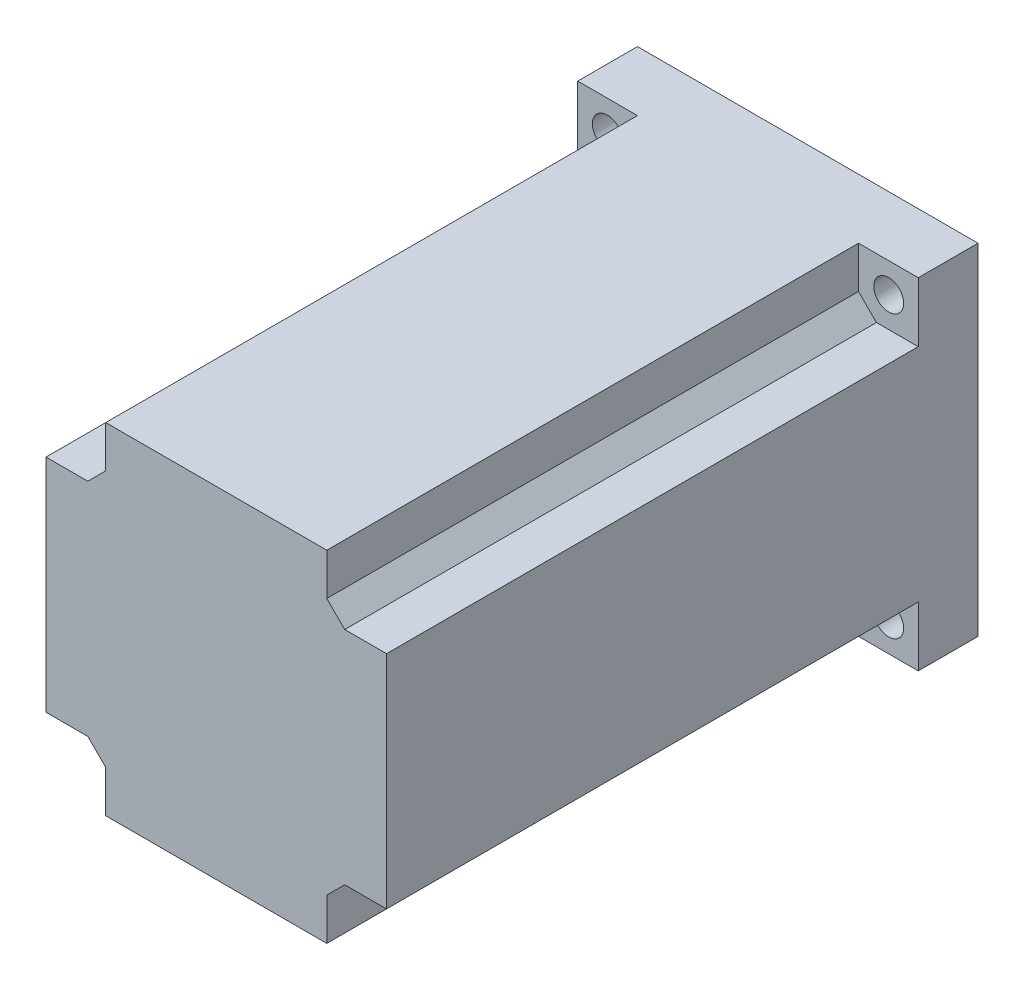
ISO-10303-21;
HEADER;
FILE_DESCRIPTION(('STEP AP214'),'2;1');
FILE_NAME('part.step','',(''),(''),'','','');
FILE_SCHEMA(('AUTOMOTIVE_DESIGN { 1 0 10303 214 1 1 1 1 }'));
ENDSEC;
DATA;
#1=APPLICATION_CONTEXT('core data for automotive mechanical design processes');
#2=APPLICATION_PROTOCOL_DEFINITION('international standard','automotive_design',2000,#1);
#3=PRODUCT_CONTEXT('',#1,'mechanical');
#4=PRODUCT('Part','Part','',(#3));
#5=PRODUCT_RELATED_PRODUCT_CATEGORY('part','',(#4));
#6=PRODUCT_DEFINITION_FORMATION('','',#4);
#7=PRODUCT_DEFINITION_CONTEXT('part definition',#1,'design');
#8=PRODUCT_DEFINITION('design','',#6,#7);
#9=PRODUCT_DEFINITION_SHAPE('','',#8);
#10=(LENGTH_UNIT() NAMED_UNIT(*) SI_UNIT(.MILLI.,.METRE.));
#11=(NAMED_UNIT(*) PLANE_ANGLE_UNIT() SI_UNIT($,.RADIAN.));
#12=(NAMED_UNIT(*) SI_UNIT($,.STERADIAN.) SOLID_ANGLE_UNIT());
#13=UNCERTAINTY_MEASURE_WITH_UNIT(LENGTH_MEASURE(1.E-05),#10,'distance_accuracy_value','');
#14=(GEOMETRIC_REPRESENTATION_CONTEXT(3) GLOBAL_UNCERTAINTY_ASSIGNED_CONTEXT((#13)) GLOBAL_UNIT_ASSIGNED_CONTEXT((#10,
#11,#12)) REPRESENTATION_CONTEXT('',''));
#15=CARTESIAN_POINT('',(0.,0.,0.));
#16=DIRECTION('',(0.,0.,1.));
#17=DIRECTION('',(1.,0.,0.));
#18=AXIS2_PLACEMENT_3D('',#15,#16,#17);
#19=CARTESIAN_POINT('',(0.,0.,99.));
#20=DIRECTION('',(0.,0.,1.));
#21=DIRECTION('',(1.,0.,0.));
#22=AXIS2_PLACEMENT_3D('',#19,#20,#21);
#23=PLANE('',#22);
#24=DIRECTION('',(0.,-1.,0.));
#25=VECTOR('',#24,1.);
#26=CARTESIAN_POINT('',(-28.5,28.5,99.));
#27=LINE('',#26,#25);
#28=CARTESIAN_POINT('',(-28.5,18.5,99.));
#29=VERTEX_POINT('',#28);
#30=CARTESIAN_POINT('',(-28.5,-18.5,99.));
#31=VERTEX_POINT('',#30);
#32=EDGE_CURVE('E208',#29,#31,#27,.T.);
#33=ORIENTED_EDGE('',*,*,#32,.T.);
#34=DIRECTION('',(1.,0.,0.));
#35=VECTOR('',#34,1.);
#36=CARTESIAN_POINT('',(-28.5,-18.5,99.));
#37=LINE('',#36,#35);
#38=CARTESIAN_POINT('',(-21.5,-18.5,99.));
#39=VERTEX_POINT('',#38);
#40=EDGE_CURVE('E329',#31,#39,#37,.T.);
#41=ORIENTED_EDGE('',*,*,#40,.T.);
#42=DIRECTION('',(0.707106781186551,-0.707106781186544,0.));
#43=VECTOR('',#42,1.);
#44=CARTESIAN_POINT('',(-21.5,-18.5,99.));
#45=LINE('',#44,#43);
#46=CARTESIAN_POINT('',(-18.5,-21.5,99.));
#47=VERTEX_POINT('',#46);
#48=EDGE_CURVE('E47',#39,#47,#45,.T.);
#49=ORIENTED_EDGE('',*,*,#48,.T.);
#50=DIRECTION('',(0.,1.,0.));
#51=VECTOR('',#50,1.);
#52=CARTESIAN_POINT('',(-18.5,-28.5,99.));
#53=LINE('',#52,#51);
#54=CARTESIAN_POINT('',(-18.5,-28.5,99.));
#55=VERTEX_POINT('',#54);
#56=EDGE_CURVE('E327',#55,#47,#53,.T.);
#57=ORIENTED_EDGE('',*,*,#56,.F.);
#58=DIRECTION('',(1.,0.,0.));
#59=VECTOR('',#58,1.);
#60=CARTESIAN_POINT('',(-28.5,-28.5,99.));
#61=LINE('',#60,#59);
#62=CARTESIAN_POINT('',(18.5,-28.5,99.));
#63=VERTEX_POINT('',#62);
#64=EDGE_CURVE('E211',#55,#63,#61,.T.);
#65=ORIENTED_EDGE('',*,*,#64,.T.);
#66=DIRECTION('',(0.,1.,0.));
#67=VECTOR('',#66,1.);
#68=CARTESIAN_POINT('',(18.5,-28.5,99.));
#69=LINE('',#68,#67);
#70=CARTESIAN_POINT('',(18.5,-21.5,99.));
#71=VERTEX_POINT('',#70);
#72=EDGE_CURVE('E289',#63,#71,#69,.T.);
#73=ORIENTED_EDGE('',*,*,#72,.T.);
#74=DIRECTION('',(0.707106781186543,0.707106781186552,0.));
#75=VECTOR('',#74,1.);
#76=CARTESIAN_POINT('',(18.5,-21.5,99.));
#77=LINE('',#76,#75);
#78=CARTESIAN_POINT('',(21.5,-18.5,99.));
#79=VERTEX_POINT('',#78);
#80=EDGE_CURVE('E283',#71,#79,#77,.T.);
#81=ORIENTED_EDGE('',*,*,#80,.T.);
#82=DIRECTION('',(-1.,0.,0.));
#83=VECTOR('',#82,1.);
#84=CARTESIAN_POINT('',(28.5,-18.5,99.));
#85=LINE('',#84,#83);
#86=CARTESIAN_POINT('',(28.5,-18.5,99.));
#87=VERTEX_POINT('',#86);
#88=EDGE_CURVE('E287',#87,#79,#85,.T.);
#89=ORIENTED_EDGE('',*,*,#88,.F.);
#90=DIRECTION('',(0.,1.,0.));
#91=VECTOR('',#90,1.);
#92=CARTESIAN_POINT('',(28.5,28.5,99.));
#93=LINE('',#92,#91);
#94=CARTESIAN_POINT('',(28.5,18.5,99.));
#95=VERTEX_POINT('',#94);
#96=EDGE_CURVE('E209',#87,#95,#93,.T.);
#97=ORIENTED_EDGE('',*,*,#96,.T.);
#98=DIRECTION('',(-1.,0.,0.));
#99=VECTOR('',#98,1.);
#100=CARTESIAN_POINT('',(28.5,18.5,99.));
#101=LINE('',#100,#99);
#102=CARTESIAN_POINT('',(21.5,18.5,99.));
#103=VERTEX_POINT('',#102);
#104=EDGE_CURVE('E201',#95,#103,#101,.T.);
#105=ORIENTED_EDGE('',*,*,#104,.T.);
#106=DIRECTION('',(-0.707106781186552,0.707106781186543,0.));
#107=VECTOR('',#106,1.);
#108=CARTESIAN_POINT('',(21.5,18.5,99.));
#109=LINE('',#108,#107);
#110=CARTESIAN_POINT('',(18.5,21.5,99.));
#111=VERTEX_POINT('',#110);
#112=EDGE_CURVE('E200',#103,#111,#109,.T.);
#113=ORIENTED_EDGE('',*,*,#112,.T.);
#114=DIRECTION('',(0.,-1.,0.));
#115=VECTOR('',#114,1.);
#116=CARTESIAN_POINT('',(18.5,28.5,99.));
#117=LINE('',#116,#115);
#118=CARTESIAN_POINT('',(18.5,28.5,99.));
#119=VERTEX_POINT('',#118);
#120=EDGE_CURVE('E184',#119,#111,#117,.T.);
#121=ORIENTED_EDGE('',*,*,#120,.F.);
#122=DIRECTION('',(-1.,0.,0.));
#123=VECTOR('',#122,1.);
#124=CARTESIAN_POINT('',(-28.5,28.5,99.));
#125=LINE('',#124,#123);
#126=CARTESIAN_POINT('',(-18.5,28.5,99.));
#127=VERTEX_POINT('',#126);
#128=EDGE_CURVE('E198',#119,#127,#125,.T.);
#129=ORIENTED_EDGE('',*,*,#128,.T.);
#130=DIRECTION('',(0.,-1.,0.));
#131=VECTOR('',#130,1.);
#132=CARTESIAN_POINT('',(-18.5,28.5,99.));
#133=LINE('',#132,#131);
#134=CARTESIAN_POINT('',(-18.5,21.5,99.));
#135=VERTEX_POINT('',#134);
#136=EDGE_CURVE('E345',#127,#135,#133,.T.);
#137=ORIENTED_EDGE('',*,*,#136,.T.);
#138=DIRECTION('',(-0.707106781186544,-0.707106781186551,0.));
#139=VECTOR('',#138,1.);
#140=CARTESIAN_POINT('',(-18.5,21.5,99.));
#141=LINE('',#140,#139);
#142=CARTESIAN_POINT('',(-21.5,18.5,99.));
#143=VERTEX_POINT('',#142);
#144=EDGE_CURVE('E281',#135,#143,#141,.T.);
#145=ORIENTED_EDGE('',*,*,#144,.T.);
#146=DIRECTION('',(1.,0.,0.));
#147=VECTOR('',#146,1.);
#148=CARTESIAN_POINT('',(-28.5,18.5,99.));
#149=LINE('',#148,#147);
#150=EDGE_CURVE('E353',#29,#143,#149,.T.);
#151=ORIENTED_EDGE('',*,*,#150,.F.);
#152=EDGE_LOOP('',(#33,#41,#49,#57,#65,#73,#81,#89,#97,#105,#113,#121,#129,#137,#145,#151));
#153=FACE_BOUND('',#152,.T.);
#154=ADVANCED_FACE('F43',(#153),#23,.T.);
#155=CARTESIAN_POINT('',(28.5,28.5,99.));
#156=DIRECTION('',(-1.,0.,0.));
#157=DIRECTION('',(0.,-1.,0.));
#158=AXIS2_PLACEMENT_3D('',#155,#156,#157);
#159=PLANE('',#158);
#160=ORIENTED_EDGE('',*,*,#96,.F.);
#161=DIRECTION('',(0.,0.,1.));
#162=VECTOR('',#161,1.);
#163=CARTESIAN_POINT('',(28.5,-18.5,10.));
#164=LINE('',#163,#162);
#165=CARTESIAN_POINT('',(28.5,-18.5,10.));
#166=VERTEX_POINT('',#165);
#167=EDGE_CURVE('E297',#166,#87,#164,.T.);
#168=ORIENTED_EDGE('',*,*,#167,.F.);
#169=DIRECTION('',(0.,1.,0.));
#170=VECTOR('',#169,1.);
#171=CARTESIAN_POINT('',(28.5,-28.5,10.));
#172=LINE('',#171,#170);
#173=CARTESIAN_POINT('',(28.5,-28.5,10.));
#174=VERTEX_POINT('',#173);
#175=EDGE_CURVE('E316',#174,#166,#172,.T.);
#176=ORIENTED_EDGE('',*,*,#175,.F.);
#177=DIRECTION('',(0.,0.,-1.));
#178=VECTOR('',#177,1.);
#179=CARTESIAN_POINT('',(28.5,-28.5,99.));
#180=LINE('',#179,#178);
#181=CARTESIAN_POINT('',(28.5,-28.5,0.));
#182=VERTEX_POINT('',#181);
#183=EDGE_CURVE('E220',#174,#182,#180,.T.);
#184=ORIENTED_EDGE('',*,*,#183,.T.);
#185=DIRECTION('',(0.,1.,0.));
#186=VECTOR('',#185,1.);
#187=CARTESIAN_POINT('',(28.5,28.5,0.));
#188=LINE('',#187,#186);
#189=CARTESIAN_POINT('',(28.5,28.5,0.));
#190=VERTEX_POINT('',#189);
#191=EDGE_CURVE('E221',#182,#190,#188,.T.);
#192=ORIENTED_EDGE('',*,*,#191,.T.);
#193=DIRECTION('',(0.,0.,-1.));
#194=VECTOR('',#193,1.);
#195=CARTESIAN_POINT('',(28.5,28.5,99.));
#196=LINE('',#195,#194);
#197=CARTESIAN_POINT('',(28.5,28.5,10.));
#198=VERTEX_POINT('',#197);
#199=EDGE_CURVE('E238',#198,#190,#196,.T.);
#200=ORIENTED_EDGE('',*,*,#199,.F.);
#201=DIRECTION('',(0.,-1.,0.));
#202=VECTOR('',#201,1.);
#203=CARTESIAN_POINT('',(28.5,28.5,10.));
#204=LINE('',#203,#202);
#205=CARTESIAN_POINT('',(28.5,18.5,10.));
#206=VERTEX_POINT('',#205);
#207=EDGE_CURVE('E202',#198,#206,#204,.T.);
#208=ORIENTED_EDGE('',*,*,#207,.T.);
#209=DIRECTION('',(0.,0.,1.));
#210=VECTOR('',#209,1.);
#211=CARTESIAN_POINT('',(28.5,18.5,10.));
#212=LINE('',#211,#210);
#213=EDGE_CURVE('E193',#206,#95,#212,.T.);
#214=ORIENTED_EDGE('',*,*,#213,.T.);
#215=EDGE_LOOP('',(#160,#168,#176,#184,#192,#200,#208,#214));
#216=FACE_BOUND('',#215,.T.);
#217=ADVANCED_FACE('F390',(#216),#159,.F.);
#218=CARTESIAN_POINT('',(-28.5,28.5,99.));
#219=DIRECTION('',(0.,-1.,0.));
#220=DIRECTION('',(0.,0.,-1.));
#221=AXIS2_PLACEMENT_3D('',#218,#219,#220);
#222=PLANE('',#221);
#223=ORIENTED_EDGE('',*,*,#128,.F.);
#224=DIRECTION('',(0.,0.,1.));
#225=VECTOR('',#224,1.);
#226=CARTESIAN_POINT('',(18.5,28.5,10.));
#227=LINE('',#226,#225);
#228=CARTESIAN_POINT('',(18.5,28.5,10.));
#229=VERTEX_POINT('',#228);
#230=EDGE_CURVE('E181',#229,#119,#227,.T.);
#231=ORIENTED_EDGE('',*,*,#230,.F.);
#232=DIRECTION('',(-1.,0.,0.));
#233=VECTOR('',#232,1.);
#234=CARTESIAN_POINT('',(28.5,28.5,10.));
#235=LINE('',#234,#233);
#236=EDGE_CURVE('E192',#198,#229,#235,.T.);
#237=ORIENTED_EDGE('',*,*,#236,.F.);
#238=ORIENTED_EDGE('',*,*,#199,.T.);
#239=DIRECTION('',(-1.,0.,0.));
#240=VECTOR('',#239,1.);
#241=CARTESIAN_POINT('',(-28.5,28.5,0.));
#242=LINE('',#241,#240);
#243=CARTESIAN_POINT('',(-28.5,28.5,0.));
#244=VERTEX_POINT('',#243);
#245=EDGE_CURVE('E224',#190,#244,#242,.T.);
#246=ORIENTED_EDGE('',*,*,#245,.T.);
#247=DIRECTION('',(0.,0.,-1.));
#248=VECTOR('',#247,1.);
#249=CARTESIAN_POINT('',(-28.5,28.5,99.));
#250=LINE('',#249,#248);
#251=CARTESIAN_POINT('',(-28.5,28.5,10.));
#252=VERTEX_POINT('',#251);
#253=EDGE_CURVE('E236',#252,#244,#250,.T.);
#254=ORIENTED_EDGE('',*,*,#253,.F.);
#255=DIRECTION('',(1.,0.,0.));
#256=VECTOR('',#255,1.);
#257=CARTESIAN_POINT('',(-28.5,28.5,10.));
#258=LINE('',#257,#256);
#259=CARTESIAN_POINT('',(-18.5,28.5,10.));
#260=VERTEX_POINT('',#259);
#261=EDGE_CURVE('E348',#252,#260,#258,.T.);
#262=ORIENTED_EDGE('',*,*,#261,.T.);
#263=DIRECTION('',(0.,0.,1.));
#264=VECTOR('',#263,1.);
#265=CARTESIAN_POINT('',(-18.5,28.5,10.));
#266=LINE('',#265,#264);
#267=EDGE_CURVE('E207',#260,#127,#266,.T.);
#268=ORIENTED_EDGE('',*,*,#267,.T.);
#269=EDGE_LOOP('',(#223,#231,#237,#238,#246,#254,#262,#268));
#270=FACE_BOUND('',#269,.T.);
#271=ADVANCED_FACE('F205',(#270),#222,.F.);
#272=CARTESIAN_POINT('',(-28.5,28.5,99.));
#273=DIRECTION('',(1.,0.,0.));
#274=DIRECTION('',(0.,1.,0.));
#275=AXIS2_PLACEMENT_3D('',#272,#273,#274);
#276=PLANE('',#275);
#277=DIRECTION('',(0.,0.,1.));
#278=VECTOR('',#277,1.);
#279=CARTESIAN_POINT('',(-28.5,-18.5,10.));
#280=LINE('',#279,#278);
#281=CARTESIAN_POINT('',(-28.5,-18.5,10.));
#282=VERTEX_POINT('',#281);
#283=EDGE_CURVE('E320',#282,#31,#280,.T.);
#284=ORIENTED_EDGE('',*,*,#283,.T.);
#285=ORIENTED_EDGE('',*,*,#32,.F.);
#286=DIRECTION('',(0.,0.,1.));
#287=VECTOR('',#286,1.);
#288=CARTESIAN_POINT('',(-28.5,18.5,10.));
#289=LINE('',#288,#287);
#290=CARTESIAN_POINT('',(-28.5,18.5,10.));
#291=VERTEX_POINT('',#290);
#292=EDGE_CURVE('E245',#291,#29,#289,.T.);
#293=ORIENTED_EDGE('',*,*,#292,.F.);
#294=DIRECTION('',(0.,-1.,0.));
#295=VECTOR('',#294,1.);
#296=CARTESIAN_POINT('',(-28.5,28.5,10.));
#297=LINE('',#296,#295);
#298=EDGE_CURVE('E350',#252,#291,#297,.T.);
#299=ORIENTED_EDGE('',*,*,#298,.F.);
#300=ORIENTED_EDGE('',*,*,#253,.T.);
#301=DIRECTION('',(0.,-1.,0.));
#302=VECTOR('',#301,1.);
#303=CARTESIAN_POINT('',(-28.5,28.5,0.));
#304=LINE('',#303,#302);
#305=CARTESIAN_POINT('',(-28.5,-28.5,0.));
#306=VERTEX_POINT('',#305);
#307=EDGE_CURVE('E228',#244,#306,#304,.T.);
#308=ORIENTED_EDGE('',*,*,#307,.T.);
#309=DIRECTION('',(0.,0.,-1.));
#310=VECTOR('',#309,1.);
#311=CARTESIAN_POINT('',(-28.5,-28.5,99.));
#312=LINE('',#311,#310);
#313=CARTESIAN_POINT('',(-28.5,-28.5,10.));
#314=VERTEX_POINT('',#313);
#315=EDGE_CURVE('E234',#314,#306,#312,.T.);
#316=ORIENTED_EDGE('',*,*,#315,.F.);
#317=DIRECTION('',(0.,1.,0.));
#318=VECTOR('',#317,1.);
#319=CARTESIAN_POINT('',(-28.5,-28.5,10.));
#320=LINE('',#319,#318);
#321=EDGE_CURVE('E330',#314,#282,#320,.T.);
#322=ORIENTED_EDGE('',*,*,#321,.T.);
#323=EDGE_LOOP('',(#284,#285,#293,#299,#300,#308,#316,#322));
#324=FACE_BOUND('',#323,.T.);
#325=ADVANCED_FACE('F399',(#324),#276,.F.);
#326=CARTESIAN_POINT('',(-28.5,-28.5,99.));
#327=DIRECTION('',(0.,1.,0.));
#328=DIRECTION('',(0.,0.,1.));
#329=AXIS2_PLACEMENT_3D('',#326,#327,#328);
#330=PLANE('',#329);
#331=ORIENTED_EDGE('',*,*,#64,.F.);
#332=DIRECTION('',(0.,0.,1.));
#333=VECTOR('',#332,1.);
#334=CARTESIAN_POINT('',(-18.5,-28.5,10.));
#335=LINE('',#334,#333);
#336=CARTESIAN_POINT('',(-18.5,-28.5,10.));
#337=VERTEX_POINT('',#336);
#338=EDGE_CURVE('E323',#337,#55,#335,.T.);
#339=ORIENTED_EDGE('',*,*,#338,.F.);
#340=DIRECTION('',(1.,0.,0.));
#341=VECTOR('',#340,1.);
#342=CARTESIAN_POINT('',(-28.5,-28.5,10.));
#343=LINE('',#342,#341);
#344=EDGE_CURVE('E326',#314,#337,#343,.T.);
#345=ORIENTED_EDGE('',*,*,#344,.F.);
#346=ORIENTED_EDGE('',*,*,#315,.T.);
#347=DIRECTION('',(1.,0.,0.));
#348=VECTOR('',#347,1.);
#349=CARTESIAN_POINT('',(-28.5,-28.5,0.));
#350=LINE('',#349,#348);
#351=EDGE_CURVE('E214',#306,#182,#350,.T.);
#352=ORIENTED_EDGE('',*,*,#351,.T.);
#353=ORIENTED_EDGE('',*,*,#183,.F.);
#354=DIRECTION('',(-1.,0.,0.));
#355=VECTOR('',#354,1.);
#356=CARTESIAN_POINT('',(28.5,-28.5,10.));
#357=LINE('',#356,#355);
#358=CARTESIAN_POINT('',(18.5,-28.5,10.));
#359=VERTEX_POINT('',#358);
#360=EDGE_CURVE('E298',#174,#359,#357,.T.);
#361=ORIENTED_EDGE('',*,*,#360,.T.);
#362=DIRECTION('',(0.,0.,1.));
#363=VECTOR('',#362,1.);
#364=CARTESIAN_POINT('',(18.5,-28.5,10.));
#365=LINE('',#364,#363);
#366=EDGE_CURVE('E313',#359,#63,#365,.T.);
#367=ORIENTED_EDGE('',*,*,#366,.T.);
#368=EDGE_LOOP('',(#331,#339,#345,#346,#352,#353,#361,#367));
#369=FACE_BOUND('',#368,.T.);
#370=ADVANCED_FACE('F384',(#369),#330,.F.);
#371=CARTESIAN_POINT('',(0.,0.,0.));
#372=DIRECTION('',(0.,0.,1.));
#373=DIRECTION('',(1.,0.,0.));
#374=AXIS2_PLACEMENT_3D('',#371,#372,#373);
#375=PLANE('',#374);
#376=CARTESIAN_POINT('',(0.,0.,0.));
#377=DIRECTION('',(0.,0.,-1.));
#378=DIRECTION('',(-1.,0.,0.));
#379=AXIS2_PLACEMENT_3D('',#376,#377,#378);
#380=CIRCLE('',#379,19.05);
#381=CARTESIAN_POINT('',(-19.05,0.,0.));
#382=VERTEX_POINT('',#381);
#383=EDGE_CURVE('E11',#382,#382,#380,.T.);
#384=ORIENTED_EDGE('',*,*,#383,.F.);
#385=EDGE_LOOP('',(#384));
#386=FACE_BOUND('',#385,.T.);
#387=ORIENTED_EDGE('',*,*,#191,.F.);
#388=ORIENTED_EDGE('',*,*,#351,.F.);
#389=ORIENTED_EDGE('',*,*,#307,.F.);
#390=ORIENTED_EDGE('',*,*,#245,.F.);
#391=EDGE_LOOP('',(#387,#388,#389,#390));
#392=FACE_BOUND('',#391,.T.);
#393=CARTESIAN_POINT('',(23.55,-23.55,0.));
#394=DIRECTION('',(0.,0.,1.));
#395=DIRECTION('',(1.,0.,0.));
#396=AXIS2_PLACEMENT_3D('',#393,#394,#395);
#397=CIRCLE('',#396,2.5);
#398=CARTESIAN_POINT('',(26.05,-23.55,0.));
#399=VERTEX_POINT('',#398);
#400=EDGE_CURVE('E225',#399,#399,#397,.T.);
#401=ORIENTED_EDGE('',*,*,#400,.T.);
#402=EDGE_LOOP('',(#401));
#403=FACE_BOUND('',#402,.T.);
#404=CARTESIAN_POINT('',(23.55,23.55,0.));
#405=DIRECTION('',(0.,0.,1.));
#406=DIRECTION('',(-1.,0.,0.));
#407=AXIS2_PLACEMENT_3D('',#404,#405,#406);
#408=CIRCLE('',#407,2.5);
#409=CARTESIAN_POINT('',(21.05,23.55,0.));
#410=VERTEX_POINT('',#409);
#411=EDGE_CURVE('E364',#410,#410,#408,.T.);
#412=ORIENTED_EDGE('',*,*,#411,.T.);
#413=EDGE_LOOP('',(#412));
#414=FACE_BOUND('',#413,.T.);
#415=CARTESIAN_POINT('',(-23.55,23.55,0.));
#416=DIRECTION('',(0.,0.,1.));
#417=DIRECTION('',(1.,0.,0.));
#418=AXIS2_PLACEMENT_3D('',#415,#416,#417);
#419=CIRCLE('',#418,2.5);
#420=CARTESIAN_POINT('',(-21.05,23.55,0.));
#421=VERTEX_POINT('',#420);
#422=EDGE_CURVE('E361',#421,#421,#419,.T.);
#423=ORIENTED_EDGE('',*,*,#422,.T.);
#424=EDGE_LOOP('',(#423));
#425=FACE_BOUND('',#424,.T.);
#426=CARTESIAN_POINT('',(-23.55,-23.55,0.));
#427=DIRECTION('',(0.,0.,1.));
#428=DIRECTION('',(-1.,0.,0.));
#429=AXIS2_PLACEMENT_3D('',#426,#427,#428);
#430=CIRCLE('',#429,2.5);
#431=CARTESIAN_POINT('',(-26.05,-23.55,0.));
#432=VERTEX_POINT('',#431);
#433=EDGE_CURVE('E254',#432,#432,#430,.T.);
#434=ORIENTED_EDGE('',*,*,#433,.T.);
#435=EDGE_LOOP('',(#434));
#436=FACE_BOUND('',#435,.T.);
#437=ADVANCED_FACE('F369',(#386,#392,#403,#414,#425,#436),#375,.F.);
#438=CARTESIAN_POINT('',(23.55,-23.55,99.));
#439=DIRECTION('',(0.,0.,-1.));
#440=DIRECTION('',(-1.,0.,0.));
#441=AXIS2_PLACEMENT_3D('',#438,#439,#440);
#442=CYLINDRICAL_SURFACE('',#441,2.5);
#443=CARTESIAN_POINT('',(23.55,-23.55,10.));
#444=DIRECTION('',(0.,0.,-1.));
#445=DIRECTION('',(-1.,0.,0.));
#446=AXIS2_PLACEMENT_3D('',#443,#444,#445);
#447=CIRCLE('',#446,2.5);
#448=CARTESIAN_POINT('',(21.05,-23.55,10.));
#449=VERTEX_POINT('',#448);
#450=EDGE_CURVE('E251',#449,#449,#447,.T.);
#451=ORIENTED_EDGE('',*,*,#450,.F.);
#452=EDGE_LOOP('',(#451));
#453=FACE_BOUND('',#452,.T.);
#454=ORIENTED_EDGE('',*,*,#400,.F.);
#455=EDGE_LOOP('',(#454));
#456=FACE_BOUND('',#455,.T.);
#457=ADVANCED_FACE('F372',(#453,#456),#442,.F.);
#458=CARTESIAN_POINT('',(23.55,23.55,99.));
#459=DIRECTION('',(0.,0.,-1.));
#460=DIRECTION('',(-1.,0.,0.));
#461=AXIS2_PLACEMENT_3D('',#458,#459,#460);
#462=CYLINDRICAL_SURFACE('',#461,2.5);
#463=CARTESIAN_POINT('',(23.55,23.55,10.));
#464=DIRECTION('',(0.,0.,-1.));
#465=DIRECTION('',(-1.,0.,0.));
#466=AXIS2_PLACEMENT_3D('',#463,#464,#465);
#467=CIRCLE('',#466,2.5);
#468=CARTESIAN_POINT('',(21.05,23.55,10.));
#469=VERTEX_POINT('',#468);
#470=EDGE_CURVE('E248',#469,#469,#467,.T.);
#471=ORIENTED_EDGE('',*,*,#470,.F.);
#472=EDGE_LOOP('',(#471));
#473=FACE_BOUND('',#472,.T.);
#474=ORIENTED_EDGE('',*,*,#411,.F.);
#475=EDGE_LOOP('',(#474));
#476=FACE_BOUND('',#475,.T.);
#477=ADVANCED_FACE('F374',(#473,#476),#462,.F.);
#478=CARTESIAN_POINT('',(-23.55,23.55,99.));
#479=DIRECTION('',(0.,0.,-1.));
#480=DIRECTION('',(-1.,0.,0.));
#481=AXIS2_PLACEMENT_3D('',#478,#479,#480);
#482=CYLINDRICAL_SURFACE('',#481,2.5);
#483=CARTESIAN_POINT('',(-23.55,23.55,10.));
#484=DIRECTION('',(0.,0.,-1.));
#485=DIRECTION('',(-1.,0.,0.));
#486=AXIS2_PLACEMENT_3D('',#483,#484,#485);
#487=CIRCLE('',#486,2.5);
#488=CARTESIAN_POINT('',(-26.05,23.55,10.));
#489=VERTEX_POINT('',#488);
#490=EDGE_CURVE('E244',#489,#489,#487,.T.);
#491=ORIENTED_EDGE('',*,*,#490,.F.);
#492=EDGE_LOOP('',(#491));
#493=FACE_BOUND('',#492,.T.);
#494=ORIENTED_EDGE('',*,*,#422,.F.);
#495=EDGE_LOOP('',(#494));
#496=FACE_BOUND('',#495,.T.);
#497=ADVANCED_FACE('F381',(#493,#496),#482,.F.);
#498=CARTESIAN_POINT('',(-23.55,-23.55,99.));
#499=DIRECTION('',(0.,0.,-1.));
#500=DIRECTION('',(-1.,0.,0.));
#501=AXIS2_PLACEMENT_3D('',#498,#499,#500);
#502=CYLINDRICAL_SURFACE('',#501,2.5);
#503=CARTESIAN_POINT('',(-23.55,-23.55,10.));
#504=DIRECTION('',(0.,0.,-1.));
#505=DIRECTION('',(-1.,0.,0.));
#506=AXIS2_PLACEMENT_3D('',#503,#504,#505);
#507=CIRCLE('',#506,2.5);
#508=CARTESIAN_POINT('',(-26.05,-23.55,10.));
#509=VERTEX_POINT('',#508);
#510=EDGE_CURVE('E241',#509,#509,#507,.T.);
#511=ORIENTED_EDGE('',*,*,#510,.F.);
#512=EDGE_LOOP('',(#511));
#513=FACE_BOUND('',#512,.T.);
#514=ORIENTED_EDGE('',*,*,#433,.F.);
#515=EDGE_LOOP('',(#514));
#516=FACE_BOUND('',#515,.T.);
#517=ADVANCED_FACE('F447',(#513,#516),#502,.F.);
#518=CARTESIAN_POINT('',(-28.5,-18.5,10.));
#519=DIRECTION('',(0.,-1.,0.));
#520=DIRECTION('',(1.,0.,0.));
#521=AXIS2_PLACEMENT_3D('',#518,#519,#520);
#522=PLANE('',#521);
#523=DIRECTION('',(1.,0.,0.));
#524=VECTOR('',#523,1.);
#525=CARTESIAN_POINT('',(-28.5,-18.5,10.));
#526=LINE('',#525,#524);
#527=CARTESIAN_POINT('',(-21.5,-18.5,10.));
#528=VERTEX_POINT('',#527);
#529=EDGE_CURVE('E336',#282,#528,#526,.T.);
#530=ORIENTED_EDGE('',*,*,#529,.T.);
#531=DIRECTION('',(0.,0.,1.));
#532=VECTOR('',#531,1.);
#533=CARTESIAN_POINT('',(-21.5,-18.5,10.));
#534=LINE('',#533,#532);
#535=EDGE_CURVE('E275',#528,#39,#534,.T.);
#536=ORIENTED_EDGE('',*,*,#535,.T.);
#537=ORIENTED_EDGE('',*,*,#40,.F.);
#538=ORIENTED_EDGE('',*,*,#283,.F.);
#539=EDGE_LOOP('',(#530,#536,#537,#538));
#540=FACE_BOUND('',#539,.T.);
#541=ADVANCED_FACE('F431',(#540),#522,.T.);
#542=CARTESIAN_POINT('',(-18.5,-28.5,10.));
#543=DIRECTION('',(1.,0.,0.));
#544=DIRECTION('',(0.,1.,0.));
#545=AXIS2_PLACEMENT_3D('',#542,#543,#544);
#546=PLANE('',#545);
#547=ORIENTED_EDGE('',*,*,#56,.T.);
#548=DIRECTION('',(0.,0.,-1.));
#549=VECTOR('',#548,1.);
#550=CARTESIAN_POINT('',(-18.5,-21.5,10.));
#551=LINE('',#550,#549);
#552=CARTESIAN_POINT('',(-18.5,-21.5,10.));
#553=VERTEX_POINT('',#552);
#554=EDGE_CURVE('E59',#47,#553,#551,.T.);
#555=ORIENTED_EDGE('',*,*,#554,.T.);
#556=DIRECTION('',(0.,1.,0.));
#557=VECTOR('',#556,1.);
#558=CARTESIAN_POINT('',(-18.5,-28.5,10.));
#559=LINE('',#558,#557);
#560=EDGE_CURVE('E334',#337,#553,#559,.T.);
#561=ORIENTED_EDGE('',*,*,#560,.F.);
#562=ORIENTED_EDGE('',*,*,#338,.T.);
#563=EDGE_LOOP('',(#547,#555,#561,#562));
#564=FACE_BOUND('',#563,.T.);
#565=ADVANCED_FACE('F437',(#564),#546,.F.);
#566=CARTESIAN_POINT('',(0.,0.,10.));
#567=DIRECTION('',(0.,0.,-1.));
#568=DIRECTION('',(-1.,0.,0.));
#569=AXIS2_PLACEMENT_3D('',#566,#567,#568);
#570=PLANE('',#569);
#571=ORIENTED_EDGE('',*,*,#510,.T.);
#572=EDGE_LOOP('',(#571));
#573=FACE_BOUND('',#572,.T.);
#574=ORIENTED_EDGE('',*,*,#560,.T.);
#575=DIRECTION('',(-0.707106781186551,0.707106781186544,0.));
#576=VECTOR('',#575,1.);
#577=CARTESIAN_POINT('',(-21.5,-18.5,10.));
#578=LINE('',#577,#576);
#579=EDGE_CURVE('E279',#553,#528,#578,.T.);
#580=ORIENTED_EDGE('',*,*,#579,.T.);
#581=ORIENTED_EDGE('',*,*,#529,.F.);
#582=ORIENTED_EDGE('',*,*,#321,.F.);
#583=ORIENTED_EDGE('',*,*,#344,.T.);
#584=EDGE_LOOP('',(#574,#580,#581,#582,#583));
#585=FACE_BOUND('',#584,.T.);
#586=ADVANCED_FACE('F428',(#573,#585),#570,.F.);
#587=CARTESIAN_POINT('',(-28.5,18.5,10.));
#588=DIRECTION('',(0.,-1.,0.));
#589=DIRECTION('',(1.,0.,0.));
#590=AXIS2_PLACEMENT_3D('',#587,#588,#589);
#591=PLANE('',#590);
#592=ORIENTED_EDGE('',*,*,#150,.T.);
#593=DIRECTION('',(0.,0.,-1.));
#594=VECTOR('',#593,1.);
#595=CARTESIAN_POINT('',(-21.5,18.5,10.));
#596=LINE('',#595,#594);
#597=CARTESIAN_POINT('',(-21.5,18.5,10.));
#598=VERTEX_POINT('',#597);
#599=EDGE_CURVE('E257',#143,#598,#596,.T.);
#600=ORIENTED_EDGE('',*,*,#599,.T.);
#601=DIRECTION('',(1.,0.,0.));
#602=VECTOR('',#601,1.);
#603=CARTESIAN_POINT('',(-28.5,18.5,10.));
#604=LINE('',#603,#602);
#605=EDGE_CURVE('E341',#291,#598,#604,.T.);
#606=ORIENTED_EDGE('',*,*,#605,.F.);
#607=ORIENTED_EDGE('',*,*,#292,.T.);
#608=EDGE_LOOP('',(#592,#600,#606,#607));
#609=FACE_BOUND('',#608,.T.);
#610=ADVANCED_FACE('F444',(#609),#591,.F.);
#611=CARTESIAN_POINT('',(-18.5,28.5,10.));
#612=DIRECTION('',(-1.,0.,0.));
#613=DIRECTION('',(0.,0.,1.));
#614=AXIS2_PLACEMENT_3D('',#611,#612,#613);
#615=PLANE('',#614);
#616=DIRECTION('',(0.,-1.,0.));
#617=VECTOR('',#616,1.);
#618=CARTESIAN_POINT('',(-18.5,28.5,10.));
#619=LINE('',#618,#617);
#620=CARTESIAN_POINT('',(-18.5,21.5,10.));
#621=VERTEX_POINT('',#620);
#622=EDGE_CURVE('E344',#260,#621,#619,.T.);
#623=ORIENTED_EDGE('',*,*,#622,.T.);
#624=DIRECTION('',(0.,0.,1.));
#625=VECTOR('',#624,1.);
#626=CARTESIAN_POINT('',(-18.5,21.5,10.));
#627=LINE('',#626,#625);
#628=EDGE_CURVE('E240',#621,#135,#627,.T.);
#629=ORIENTED_EDGE('',*,*,#628,.T.);
#630=ORIENTED_EDGE('',*,*,#136,.F.);
#631=ORIENTED_EDGE('',*,*,#267,.F.);
#632=EDGE_LOOP('',(#623,#629,#630,#631));
#633=FACE_BOUND('',#632,.T.);
#634=ADVANCED_FACE('F455',(#633),#615,.T.);
#635=CARTESIAN_POINT('',(0.,0.,10.));
#636=DIRECTION('',(0.,0.,-1.));
#637=DIRECTION('',(-1.,0.,0.));
#638=AXIS2_PLACEMENT_3D('',#635,#636,#637);
#639=PLANE('',#638);
#640=ORIENTED_EDGE('',*,*,#490,.T.);
#641=EDGE_LOOP('',(#640));
#642=FACE_BOUND('',#641,.T.);
#643=ORIENTED_EDGE('',*,*,#605,.T.);
#644=DIRECTION('',(0.707106781186544,0.707106781186551,0.));
#645=VECTOR('',#644,1.);
#646=CARTESIAN_POINT('',(-18.5,21.5,10.));
#647=LINE('',#646,#645);
#648=EDGE_CURVE('E259',#598,#621,#647,.T.);
#649=ORIENTED_EDGE('',*,*,#648,.T.);
#650=ORIENTED_EDGE('',*,*,#622,.F.);
#651=ORIENTED_EDGE('',*,*,#261,.F.);
#652=ORIENTED_EDGE('',*,*,#298,.T.);
#653=EDGE_LOOP('',(#643,#649,#650,#651,#652));
#654=FACE_BOUND('',#653,.T.);
#655=ADVANCED_FACE('F451',(#642,#654),#639,.F.);
#656=CARTESIAN_POINT('',(28.5,18.5,10.));
#657=DIRECTION('',(0.,1.,0.));
#658=DIRECTION('',(-1.,0.,0.));
#659=AXIS2_PLACEMENT_3D('',#656,#657,#658);
#660=PLANE('',#659);
#661=DIRECTION('',(-1.,0.,0.));
#662=VECTOR('',#661,1.);
#663=CARTESIAN_POINT('',(28.5,18.5,10.));
#664=LINE('',#663,#662);
#665=CARTESIAN_POINT('',(21.5,18.5,10.));
#666=VERTEX_POINT('',#665);
#667=EDGE_CURVE('E500',#206,#666,#664,.T.);
#668=ORIENTED_EDGE('',*,*,#667,.T.);
#669=DIRECTION('',(0.,0.,1.));
#670=VECTOR('',#669,1.);
#671=CARTESIAN_POINT('',(21.5,18.5,10.));
#672=LINE('',#671,#670);
#673=EDGE_CURVE('E261',#666,#103,#672,.T.);
#674=ORIENTED_EDGE('',*,*,#673,.T.);
#675=ORIENTED_EDGE('',*,*,#104,.F.);
#676=ORIENTED_EDGE('',*,*,#213,.F.);
#677=EDGE_LOOP('',(#668,#674,#675,#676));
#678=FACE_BOUND('',#677,.T.);
#679=ADVANCED_FACE('F454',(#678),#660,.T.);
#680=CARTESIAN_POINT('',(18.5,28.5,10.));
#681=DIRECTION('',(-1.,0.,0.));
#682=DIRECTION('',(0.,0.,1.));
#683=AXIS2_PLACEMENT_3D('',#680,#681,#682);
#684=PLANE('',#683);
#685=ORIENTED_EDGE('',*,*,#120,.T.);
#686=DIRECTION('',(0.,0.,-1.));
#687=VECTOR('',#686,1.);
#688=CARTESIAN_POINT('',(18.5,21.5,10.));
#689=LINE('',#688,#687);
#690=CARTESIAN_POINT('',(18.5,21.5,10.));
#691=VERTEX_POINT('',#690);
#692=EDGE_CURVE('E264',#111,#691,#689,.T.);
#693=ORIENTED_EDGE('',*,*,#692,.T.);
#694=DIRECTION('',(0.,-1.,0.));
#695=VECTOR('',#694,1.);
#696=CARTESIAN_POINT('',(18.5,28.5,10.));
#697=LINE('',#696,#695);
#698=EDGE_CURVE('E187',#229,#691,#697,.T.);
#699=ORIENTED_EDGE('',*,*,#698,.F.);
#700=ORIENTED_EDGE('',*,*,#230,.T.);
#701=EDGE_LOOP('',(#685,#693,#699,#700));
#702=FACE_BOUND('',#701,.T.);
#703=ADVANCED_FACE('F183',(#702),#684,.F.);
#704=CARTESIAN_POINT('',(0.,0.,10.));
#705=DIRECTION('',(0.,0.,-1.));
#706=DIRECTION('',(-1.,0.,0.));
#707=AXIS2_PLACEMENT_3D('',#704,#705,#706);
#708=PLANE('',#707);
#709=ORIENTED_EDGE('',*,*,#470,.T.);
#710=EDGE_LOOP('',(#709));
#711=FACE_BOUND('',#710,.T.);
#712=ORIENTED_EDGE('',*,*,#698,.T.);
#713=DIRECTION('',(0.707106781186552,-0.707106781186543,0.));
#714=VECTOR('',#713,1.);
#715=CARTESIAN_POINT('',(21.5,18.5,10.));
#716=LINE('',#715,#714);
#717=EDGE_CURVE('E266',#691,#666,#716,.T.);
#718=ORIENTED_EDGE('',*,*,#717,.T.);
#719=ORIENTED_EDGE('',*,*,#667,.F.);
#720=ORIENTED_EDGE('',*,*,#207,.F.);
#721=ORIENTED_EDGE('',*,*,#236,.T.);
#722=EDGE_LOOP('',(#712,#718,#719,#720,#721));
#723=FACE_BOUND('',#722,.T.);
#724=ADVANCED_FACE('F540',(#711,#723),#708,.F.);
#725=CARTESIAN_POINT('',(18.5,-28.5,10.));
#726=DIRECTION('',(1.,0.,0.));
#727=DIRECTION('',(0.,1.,0.));
#728=AXIS2_PLACEMENT_3D('',#725,#726,#727);
#729=PLANE('',#728);
#730=DIRECTION('',(0.,1.,0.));
#731=VECTOR('',#730,1.);
#732=CARTESIAN_POINT('',(18.5,-28.5,10.));
#733=LINE('',#732,#731);
#734=CARTESIAN_POINT('',(18.5,-21.5,10.));
#735=VERTEX_POINT('',#734);
#736=EDGE_CURVE('E306',#359,#735,#733,.T.);
#737=ORIENTED_EDGE('',*,*,#736,.T.);
#738=DIRECTION('',(0.,0.,1.));
#739=VECTOR('',#738,1.);
#740=CARTESIAN_POINT('',(18.5,-21.5,10.));
#741=LINE('',#740,#739);
#742=EDGE_CURVE('E268',#735,#71,#741,.T.);
#743=ORIENTED_EDGE('',*,*,#742,.T.);
#744=ORIENTED_EDGE('',*,*,#72,.F.);
#745=ORIENTED_EDGE('',*,*,#366,.F.);
#746=EDGE_LOOP('',(#737,#743,#744,#745));
#747=FACE_BOUND('',#746,.T.);
#748=ADVANCED_FACE('F311',(#747),#729,.T.);
#749=CARTESIAN_POINT('',(28.5,-18.5,10.));
#750=DIRECTION('',(0.,1.,0.));
#751=DIRECTION('',(-1.,0.,0.));
#752=AXIS2_PLACEMENT_3D('',#749,#750,#751);
#753=PLANE('',#752);
#754=ORIENTED_EDGE('',*,*,#88,.T.);
#755=DIRECTION('',(0.,0.,-1.));
#756=VECTOR('',#755,1.);
#757=CARTESIAN_POINT('',(21.5,-18.5,10.));
#758=LINE('',#757,#756);
#759=CARTESIAN_POINT('',(21.5,-18.5,10.));
#760=VERTEX_POINT('',#759);
#761=EDGE_CURVE('E271',#79,#760,#758,.T.);
#762=ORIENTED_EDGE('',*,*,#761,.T.);
#763=DIRECTION('',(-1.,0.,0.));
#764=VECTOR('',#763,1.);
#765=CARTESIAN_POINT('',(28.5,-18.5,10.));
#766=LINE('',#765,#764);
#767=EDGE_CURVE('E309',#166,#760,#766,.T.);
#768=ORIENTED_EDGE('',*,*,#767,.F.);
#769=ORIENTED_EDGE('',*,*,#167,.T.);
#770=EDGE_LOOP('',(#754,#762,#768,#769));
#771=FACE_BOUND('',#770,.T.);
#772=ADVANCED_FACE('F294',(#771),#753,.F.);
#773=CARTESIAN_POINT('',(0.,0.,10.));
#774=DIRECTION('',(0.,0.,-1.));
#775=DIRECTION('',(-1.,0.,0.));
#776=AXIS2_PLACEMENT_3D('',#773,#774,#775);
#777=PLANE('',#776);
#778=ORIENTED_EDGE('',*,*,#450,.T.);
#779=EDGE_LOOP('',(#778));
#780=FACE_BOUND('',#779,.T.);
#781=ORIENTED_EDGE('',*,*,#767,.T.);
#782=DIRECTION('',(-0.707106781186543,-0.707106781186552,0.));
#783=VECTOR('',#782,1.);
#784=CARTESIAN_POINT('',(18.5,-21.5,10.));
#785=LINE('',#784,#783);
#786=EDGE_CURVE('E273',#760,#735,#785,.T.);
#787=ORIENTED_EDGE('',*,*,#786,.T.);
#788=ORIENTED_EDGE('',*,*,#736,.F.);
#789=ORIENTED_EDGE('',*,*,#360,.F.);
#790=ORIENTED_EDGE('',*,*,#175,.T.);
#791=EDGE_LOOP('',(#781,#787,#788,#789,#790));
#792=FACE_BOUND('',#791,.T.);
#793=ADVANCED_FACE('F305',(#780,#792),#777,.F.);
#794=CARTESIAN_POINT('',(-18.5,21.5,10.));
#795=DIRECTION('',(0.707106781186551,-0.707106781186544,0.));
#796=DIRECTION('',(0.,0.,1.));
#797=AXIS2_PLACEMENT_3D('',#794,#795,#796);
#798=PLANE('',#797);
#799=ORIENTED_EDGE('',*,*,#648,.F.);
#800=ORIENTED_EDGE('',*,*,#599,.F.);
#801=ORIENTED_EDGE('',*,*,#144,.F.);
#802=ORIENTED_EDGE('',*,*,#628,.F.);
#803=EDGE_LOOP('',(#799,#800,#801,#802));
#804=FACE_BOUND('',#803,.T.);
#805=ADVANCED_FACE('F406',(#804),#798,.F.);
#806=CARTESIAN_POINT('',(21.5,18.5,10.));
#807=DIRECTION('',(-0.707106781186543,-0.707106781186552,0.));
#808=DIRECTION('',(0.,0.,1.));
#809=AXIS2_PLACEMENT_3D('',#806,#807,#808);
#810=PLANE('',#809);
#811=ORIENTED_EDGE('',*,*,#717,.F.);
#812=ORIENTED_EDGE('',*,*,#692,.F.);
#813=ORIENTED_EDGE('',*,*,#112,.F.);
#814=ORIENTED_EDGE('',*,*,#673,.F.);
#815=EDGE_LOOP('',(#811,#812,#813,#814));
#816=FACE_BOUND('',#815,.T.);
#817=ADVANCED_FACE('F409',(#816),#810,.F.);
#818=CARTESIAN_POINT('',(18.5,-21.5,10.));
#819=DIRECTION('',(-0.707106781186552,0.707106781186543,0.));
#820=DIRECTION('',(0.,0.,1.));
#821=AXIS2_PLACEMENT_3D('',#818,#819,#820);
#822=PLANE('',#821);
#823=ORIENTED_EDGE('',*,*,#786,.F.);
#824=ORIENTED_EDGE('',*,*,#761,.F.);
#825=ORIENTED_EDGE('',*,*,#80,.F.);
#826=ORIENTED_EDGE('',*,*,#742,.F.);
#827=EDGE_LOOP('',(#823,#824,#825,#826));
#828=FACE_BOUND('',#827,.T.);
#829=ADVANCED_FACE('F301',(#828),#822,.F.);
#830=CARTESIAN_POINT('',(-21.5,-18.5,10.));
#831=DIRECTION('',(0.707106781186544,0.707106781186551,0.));
#832=DIRECTION('',(0.,0.,1.));
#833=AXIS2_PLACEMENT_3D('',#830,#831,#832);
#834=PLANE('',#833);
#835=ORIENTED_EDGE('',*,*,#579,.F.);
#836=ORIENTED_EDGE('',*,*,#554,.F.);
#837=ORIENTED_EDGE('',*,*,#48,.F.);
#838=ORIENTED_EDGE('',*,*,#535,.F.);
#839=EDGE_LOOP('',(#835,#836,#837,#838));
#840=FACE_BOUND('',#839,.T.);
#841=ADVANCED_FACE('F45',(#840),#834,.F.);
#842=CARTESIAN_POINT('',(0.,0.,-1.6));
#843=DIRECTION('',(0.,0.,1.));
#844=DIRECTION('',(1.,0.,0.));
#845=AXIS2_PLACEMENT_3D('',#842,#843,#844);
#846=CYLINDRICAL_SURFACE('',#845,19.05);
#847=CARTESIAN_POINT('',(0.,0.,-1.6));
#848=DIRECTION('',(0.,0.,-1.));
#849=DIRECTION('',(-1.,0.,0.));
#850=AXIS2_PLACEMENT_3D('',#847,#848,#849);
#851=CIRCLE('',#850,19.05);
#852=CARTESIAN_POINT('',(-19.05,0.,-1.6));
#853=VERTEX_POINT('',#852);
#854=EDGE_CURVE('E324',#853,#853,#851,.T.);
#855=ORIENTED_EDGE('',*,*,#854,.F.);
#856=EDGE_LOOP('',(#855));
#857=FACE_BOUND('',#856,.T.);
#858=ORIENTED_EDGE('',*,*,#383,.T.);
#859=EDGE_LOOP('',(#858));
#860=FACE_BOUND('',#859,.T.);
#861=ADVANCED_FACE('F417',(#857,#860),#846,.T.);
#862=CARTESIAN_POINT('',(0.,0.,-1.6));
#863=DIRECTION('',(0.,0.,-1.));
#864=DIRECTION('',(-1.,0.,0.));
#865=AXIS2_PLACEMENT_3D('',#862,#863,#864);
#866=PLANE('',#865);
#867=CARTESIAN_POINT('',(0.,0.,-1.6));
#868=DIRECTION('',(0.,0.,-1.));
#869=DIRECTION('',(-1.,0.,0.));
#870=AXIS2_PLACEMENT_3D('',#867,#868,#869);
#871=CIRCLE('',#870,4.02563902510176);
#872=CARTESIAN_POINT('',(-4.02563902510176,0.,-1.6));
#873=VERTEX_POINT('',#872);
#874=EDGE_CURVE('E511',#873,#873,#871,.T.);
#875=ORIENTED_EDGE('',*,*,#874,.F.);
#876=EDGE_LOOP('',(#875));
#877=FACE_BOUND('',#876,.T.);
#878=ORIENTED_EDGE('',*,*,#854,.T.);
#879=EDGE_LOOP('',(#878));
#880=FACE_BOUND('',#879,.T.);
#881=ADVANCED_FACE('F422',(#877,#880),#866,.T.);
#882=CARTESIAN_POINT('',(0.,0.,0.));
#883=DIRECTION('',(0.,0.,-1.));
#884=DIRECTION('',(-1.,0.,0.));
#885=AXIS2_PLACEMENT_3D('',#882,#883,#884);
#886=CYLINDRICAL_SURFACE('',#885,4.02563902510176);
#887=CARTESIAN_POINT('',(0.,0.,0.));
#888=DIRECTION('',(0.,0.,-1.));
#889=DIRECTION('',(-1.,0.,0.));
#890=AXIS2_PLACEMENT_3D('',#887,#888,#889);
#891=CIRCLE('',#890,4.02563902510176);
#892=CARTESIAN_POINT('',(-4.02563902510176,0.,0.));
#893=VERTEX_POINT('',#892);
#894=EDGE_CURVE('E510',#893,#893,#891,.T.);
#895=ORIENTED_EDGE('',*,*,#894,.F.);
#896=EDGE_LOOP('',(#895));
#897=FACE_BOUND('',#896,.T.);
#898=ORIENTED_EDGE('',*,*,#874,.T.);
#899=EDGE_LOOP('',(#898));
#900=FACE_BOUND('',#899,.T.);
#901=ADVANCED_FACE('F519',(#897,#900),#886,.F.);
#902=CARTESIAN_POINT('',(0.,0.,0.));
#903=DIRECTION('',(0.,0.,-1.));
#904=DIRECTION('',(-1.,0.,0.));
#905=AXIS2_PLACEMENT_3D('',#902,#903,#904);
#906=PLANE('',#905);
#907=ORIENTED_EDGE('',*,*,#894,.T.);
#908=EDGE_LOOP('',(#907));
#909=FACE_BOUND('',#908,.T.);
#910=ADVANCED_FACE('F517',(#909),#906,.T.);
#911=CLOSED_SHELL('',(#154,#217,#271,#325,#370,#437,#457,#477,#497,#517,#541,#565,#586,#610,
#634,#655,#679,#703,#724,#748,#772,#793,#805,#817,#829,#841,#861,#881,#901,#910));
#912=MANIFOLD_SOLID_BREP('B2',#911);
#913=ADVANCED_BREP_SHAPE_REPRESENTATION('',(#18,#912),#14);
#914=SHAPE_DEFINITION_REPRESENTATION(#9,#913);
ENDSEC;
END-ISO-10303-21;
